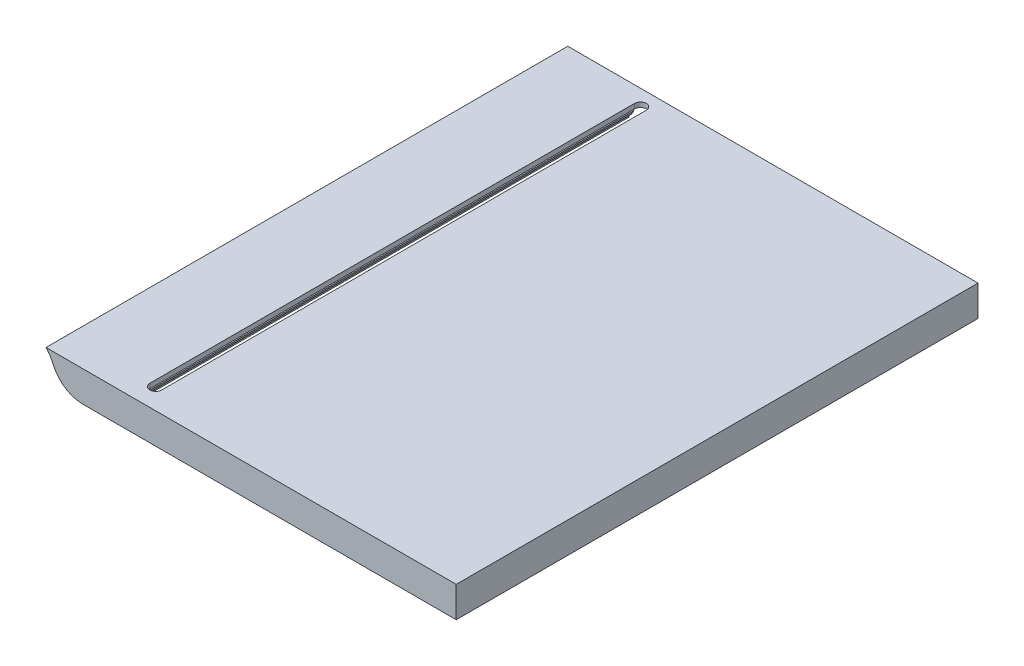
ISO-10303-21;
HEADER;
FILE_DESCRIPTION(('STEP AP214'),'2;1');
FILE_NAME('part.step','',(''),(''),'','','');
FILE_SCHEMA(('AUTOMOTIVE_DESIGN { 1 0 10303 214 1 1 1 1 }'));
ENDSEC;
DATA;
#1=APPLICATION_CONTEXT('core data for automotive mechanical design processes');
#2=APPLICATION_PROTOCOL_DEFINITION('international standard','automotive_design',2000,#1);
#3=PRODUCT_CONTEXT('',#1,'mechanical');
#4=PRODUCT('Part','Part','',(#3));
#5=PRODUCT_RELATED_PRODUCT_CATEGORY('part','',(#4));
#6=PRODUCT_DEFINITION_FORMATION('','',#4);
#7=PRODUCT_DEFINITION_CONTEXT('part definition',#1,'design');
#8=PRODUCT_DEFINITION('design','',#6,#7);
#9=PRODUCT_DEFINITION_SHAPE('','',#8);
#10=(LENGTH_UNIT() NAMED_UNIT(*) SI_UNIT(.MILLI.,.METRE.));
#11=(NAMED_UNIT(*) PLANE_ANGLE_UNIT() SI_UNIT($,.RADIAN.));
#12=(NAMED_UNIT(*) SI_UNIT($,.STERADIAN.) SOLID_ANGLE_UNIT());
#13=UNCERTAINTY_MEASURE_WITH_UNIT(LENGTH_MEASURE(1.E-05),#10,'distance_accuracy_value','');
#14=(GEOMETRIC_REPRESENTATION_CONTEXT(3) GLOBAL_UNCERTAINTY_ASSIGNED_CONTEXT((#13)) GLOBAL_UNIT_ASSIGNED_CONTEXT((#10,
#11,#12)) REPRESENTATION_CONTEXT('',''));
#15=CARTESIAN_POINT('',(0.,0.,0.));
#16=DIRECTION('',(0.,0.,1.));
#17=DIRECTION('',(1.,0.,0.));
#18=AXIS2_PLACEMENT_3D('',#15,#16,#17);
#19=CARTESIAN_POINT('',(-67.3,-102.,100.67082039325));
#20=DIRECTION('',(-0.707106781186531,0.707106781186564,0.));
#21=DIRECTION('',(-0.707106781186564,-0.707106781186531,0.));
#22=AXIS2_PLACEMENT_3D('',#19,#20,#21);
#23=PLANE('',#22);
#24=DIRECTION('',(0.,0.,-1.));
#25=VECTOR('',#24,1.);
#26=CARTESIAN_POINT('',(-67.,-101.7,100.67082039325));
#27=LINE('',#26,#25);
#28=CARTESIAN_POINT('',(-67.,-101.7,-56.8249999999984));
#29=VERTEX_POINT('',#28);
#30=CARTESIAN_POINT('',(-67.,-101.7,-59.9999999999999));
#31=VERTEX_POINT('',#30);
#32=EDGE_CURVE('E391',#29,#31,#27,.T.);
#33=ORIENTED_EDGE('',*,*,#32,.F.);
#34=CARTESIAN_POINT('',(-67.0000000000008,-101.700000000001,-55.));
#35=DIRECTION('',(-0.707106781186531,0.707106781186564,0.));
#36=DIRECTION('',(0.707106781186564,0.707106781186531,0.));
#37=AXIS2_PLACEMENT_3D('',#34,#35,#36);
#38=ELLIPSE('',#37,2.5809397513287,1.82499999999849);
#39=CARTESIAN_POINT('',(-67.3,-102.,-56.800173602738));
#40=VERTEX_POINT('',#39);
#41=EDGE_CURVE('E531',#29,#40,#38,.T.);
#42=ORIENTED_EDGE('',*,*,#41,.T.);
#43=DIRECTION('',(0.,0.,-1.));
#44=VECTOR('',#43,1.);
#45=CARTESIAN_POINT('',(-67.3,-102.,100.67082039325));
#46=LINE('',#45,#44);
#47=CARTESIAN_POINT('',(-67.3,-102.,-59.9999999999999));
#48=VERTEX_POINT('',#47);
#49=EDGE_CURVE('E400',#40,#48,#46,.T.);
#50=ORIENTED_EDGE('',*,*,#49,.T.);
#51=DIRECTION('',(0.707106781186564,0.707106781186531,0.));
#52=VECTOR('',#51,1.);
#53=CARTESIAN_POINT('',(17.3500000000015,-17.3500000000023,-60.));
#54=LINE('',#53,#52);
#55=EDGE_CURVE('E408',#48,#31,#54,.T.);
#56=ORIENTED_EDGE('',*,*,#55,.T.);
#57=EDGE_LOOP('',(#33,#42,#50,#56));
#58=FACE_BOUND('',#57,.T.);
#59=ADVANCED_FACE('F33',(#58),#23,.F.);
#60=CARTESIAN_POINT('',(-67.,-101.7,100.67082039325));
#61=DIRECTION('',(0.707106781186531,0.707106781186564,0.));
#62=DIRECTION('',(-0.707106781186564,0.707106781186531,0.));
#63=AXIS2_PLACEMENT_3D('',#60,#61,#62);
#64=PLANE('',#63);
#65=DIRECTION('',(0.,0.,-1.));
#66=VECTOR('',#65,1.);
#67=CARTESIAN_POINT('',(-66.7,-102.,100.67082039325));
#68=LINE('',#67,#66);
#69=CARTESIAN_POINT('',(-66.7,-102.,-56.8001736027377));
#70=VERTEX_POINT('',#69);
#71=CARTESIAN_POINT('',(-66.7,-102.,-60.));
#72=VERTEX_POINT('',#71);
#73=EDGE_CURVE('E395',#70,#72,#68,.T.);
#74=ORIENTED_EDGE('',*,*,#73,.F.);
#75=CARTESIAN_POINT('',(-67.0000000000008,-101.699999999999,-55.));
#76=DIRECTION('',(0.707106781186531,0.707106781186564,0.));
#77=DIRECTION('',(-0.707106781186564,0.707106781186531,0.));
#78=AXIS2_PLACEMENT_3D('',#75,#76,#77);
#79=ELLIPSE('',#78,2.58093975132872,1.82499999999849);
#80=EDGE_CURVE('E511',#70,#29,#79,.T.);
#81=ORIENTED_EDGE('',*,*,#80,.T.);
#82=ORIENTED_EDGE('',*,*,#32,.T.);
#83=DIRECTION('',(0.707106781186564,-0.707106781186531,0.));
#84=VECTOR('',#83,1.);
#85=CARTESIAN_POINT('',(-84.3499999999984,-84.3500000000023,-60.));
#86=LINE('',#85,#84);
#87=EDGE_CURVE('E405',#31,#72,#86,.T.);
#88=ORIENTED_EDGE('',*,*,#87,.T.);
#89=EDGE_LOOP('',(#74,#81,#82,#88));
#90=FACE_BOUND('',#89,.T.);
#91=ADVANCED_FACE('F627',(#90),#64,.F.);
#92=CARTESIAN_POINT('',(-91.5328115921767,-102.,80.));
#93=DIRECTION('',(0.,-1.,0.));
#94=DIRECTION('',(0.,0.,-1.));
#95=AXIS2_PLACEMENT_3D('',#92,#93,#94);
#96=PLANE('',#95);
#97=DIRECTION('',(0.,0.,-1.));
#98=VECTOR('',#97,1.);
#99=CARTESIAN_POINT('',(-76.7499999999993,-102.,80.));
#100=LINE('',#99,#98);
#101=CARTESIAN_POINT('',(-76.7499999999996,-102.,100.));
#102=VERTEX_POINT('',#101);
#103=CARTESIAN_POINT('',(-76.7499999999996,-102.,-60.));
#104=VERTEX_POINT('',#103);
#105=EDGE_CURVE('E342',#102,#104,#100,.T.);
#106=ORIENTED_EDGE('',*,*,#105,.F.);
#107=DIRECTION('',(1.,0.,0.));
#108=VECTOR('',#107,1.);
#109=CARTESIAN_POINT('',(-91.5328115921767,-102.,100.));
#110=LINE('',#109,#108);
#111=CARTESIAN_POINT('',(-91.5328115921767,-102.,100.));
#112=VERTEX_POINT('',#111);
#113=EDGE_CURVE('E456',#112,#102,#110,.T.);
#114=ORIENTED_EDGE('',*,*,#113,.F.);
#115=DIRECTION('',(0.,0.,1.));
#116=VECTOR('',#115,1.);
#117=CARTESIAN_POINT('',(-91.5328115921767,-102.,80.));
#118=LINE('',#117,#116);
#119=CARTESIAN_POINT('',(-91.5328115921768,-102.,-60.));
#120=VERTEX_POINT('',#119);
#121=EDGE_CURVE('E464',#120,#112,#118,.T.);
#122=ORIENTED_EDGE('',*,*,#121,.F.);
#123=DIRECTION('',(1.,0.,0.));
#124=VECTOR('',#123,1.);
#125=CARTESIAN_POINT('',(-91.5328115921768,-102.,-60.));
#126=LINE('',#125,#124);
#127=EDGE_CURVE('E421',#120,#104,#126,.T.);
#128=ORIENTED_EDGE('',*,*,#127,.T.);
#129=EDGE_LOOP('',(#106,#114,#122,#128));
#130=FACE_BOUND('',#129,.T.);
#131=ADVANCED_FACE('F636',(#130),#96,.T.);
#132=CARTESIAN_POINT('',(-101.758107565017,-107.555793957317,100.));
#133=DIRECTION('',(0.,0.,-1.));
#134=DIRECTION('',(-1.,0.,0.));
#135=AXIS2_PLACEMENT_3D('',#132,#133,#134);
#136=PLANE('',#135);
#137=DIRECTION('',(0.,-1.,0.));
#138=VECTOR('',#137,1.);
#139=CARTESIAN_POINT('',(-76.7499999999992,-100.5,100.));
#140=LINE('',#139,#138);
#141=CARTESIAN_POINT('',(-76.7499999999996,-108.5,100.));
#142=VERTEX_POINT('',#141);
#143=EDGE_CURVE('E304',#102,#142,#140,.T.);
#144=ORIENTED_EDGE('',*,*,#143,.T.);
#145=DIRECTION('',(-1.,0.,0.));
#146=VECTOR('',#145,1.);
#147=CARTESIAN_POINT('',(31.,-108.5,100.));
#148=LINE('',#147,#146);
#149=CARTESIAN_POINT('',(-83.,-108.5,100.));
#150=VERTEX_POINT('',#149);
#151=EDGE_CURVE('E445',#142,#150,#148,.T.);
#152=ORIENTED_EDGE('',*,*,#151,.T.);
#153=CARTESIAN_POINT('',(-83.,-99.8628386524749,100.));
#154=DIRECTION('',(0.,0.,-1.));
#155=DIRECTION('',(-1.,0.,0.));
#156=AXIS2_PLACEMENT_3D('',#153,#154,#155);
#157=CIRCLE('',#156,8.63716134752513);
#158=CARTESIAN_POINT('',(-90.9912312756488,-103.14015139957,100.));
#159=VERTEX_POINT('',#158);
#160=EDGE_CURVE('E449',#150,#159,#157,.T.);
#161=ORIENTED_EDGE('',*,*,#160,.T.);
#162=CARTESIAN_POINT('',(-101.758107565017,-107.555793957317,100.));
#163=DIRECTION('',(0.,0.,1.));
#164=DIRECTION('',(-1.,0.,0.));
#165=AXIS2_PLACEMENT_3D('',#162,#163,#164);
#166=CIRCLE('',#165,11.6371613475259);
#167=EDGE_CURVE('E452',#159,#112,#166,.T.);
#168=ORIENTED_EDGE('',*,*,#167,.T.);
#169=ORIENTED_EDGE('',*,*,#113,.T.);
#170=EDGE_LOOP('',(#144,#152,#161,#168,#169));
#171=FACE_BOUND('',#170,.T.);
#172=ADVANCED_FACE('F666',(#171),#136,.T.);
#173=DIRECTION('',(0.,1.,0.));
#174=VECTOR('',#173,1.);
#175=CARTESIAN_POINT('',(-57.25,-110.,100.));
#176=LINE('',#175,#174);
#177=CARTESIAN_POINT('',(-57.2499999999992,-108.5,100.));
#178=VERTEX_POINT('',#177);
#179=CARTESIAN_POINT('',(-57.2499999999992,-102.,100.));
#180=VERTEX_POINT('',#179);
#181=EDGE_CURVE('E306',#178,#180,#176,.T.);
#182=ORIENTED_EDGE('',*,*,#181,.T.);
#183=CARTESIAN_POINT('',(31.,-102.,100.));
#184=VERTEX_POINT('',#183);
#185=EDGE_CURVE('E455',#180,#184,#110,.T.);
#186=ORIENTED_EDGE('',*,*,#185,.T.);
#187=DIRECTION('',(0.,-1.,0.));
#188=VECTOR('',#187,1.);
#189=CARTESIAN_POINT('',(31.,-102.,100.));
#190=LINE('',#189,#188);
#191=CARTESIAN_POINT('',(31.,-108.5,100.));
#192=VERTEX_POINT('',#191);
#193=EDGE_CURVE('E442',#184,#192,#190,.T.);
#194=ORIENTED_EDGE('',*,*,#193,.T.);
#195=EDGE_CURVE('E446',#192,#178,#148,.T.);
#196=ORIENTED_EDGE('',*,*,#195,.T.);
#197=EDGE_LOOP('',(#182,#186,#194,#196));
#198=FACE_BOUND('',#197,.T.);
#199=ADVANCED_FACE('F614',(#198),#136,.T.);
#200=DIRECTION('',(0.,0.,1.));
#201=VECTOR('',#200,1.);
#202=CARTESIAN_POINT('',(-57.2499999999993,-102.,80.));
#203=LINE('',#202,#201);
#204=CARTESIAN_POINT('',(-57.2499999999992,-102.,-60.));
#205=VERTEX_POINT('',#204);
#206=EDGE_CURVE('E339',#205,#180,#203,.T.);
#207=ORIENTED_EDGE('',*,*,#206,.F.);
#208=CARTESIAN_POINT('',(31.,-102.,-60.));
#209=VERTEX_POINT('',#208);
#210=EDGE_CURVE('E420',#205,#209,#126,.T.);
#211=ORIENTED_EDGE('',*,*,#210,.T.);
#212=DIRECTION('',(0.,0.,1.));
#213=VECTOR('',#212,1.);
#214=CARTESIAN_POINT('',(31.,-102.,80.));
#215=LINE('',#214,#213);
#216=EDGE_CURVE('E459',#209,#184,#215,.T.);
#217=ORIENTED_EDGE('',*,*,#216,.T.);
#218=ORIENTED_EDGE('',*,*,#185,.F.);
#219=EDGE_LOOP('',(#207,#211,#217,#218));
#220=FACE_BOUND('',#219,.T.);
#221=ADVANCED_FACE('F599',(#220),#96,.T.);
#222=CARTESIAN_POINT('',(31.,-108.5,80.));
#223=DIRECTION('',(0.,1.,0.));
#224=DIRECTION('',(0.,0.,1.));
#225=AXIS2_PLACEMENT_3D('',#222,#223,#224);
#226=PLANE('',#225);
#227=DIRECTION('',(0.,0.,1.));
#228=VECTOR('',#227,1.);
#229=CARTESIAN_POINT('',(-76.7499999999999,-108.5,80.));
#230=LINE('',#229,#228);
#231=CARTESIAN_POINT('',(-76.7499999999996,-108.5,-60.));
#232=VERTEX_POINT('',#231);
#233=EDGE_CURVE('E345',#232,#142,#230,.T.);
#234=ORIENTED_EDGE('',*,*,#233,.F.);
#235=DIRECTION('',(-1.,0.,0.));
#236=VECTOR('',#235,1.);
#237=CARTESIAN_POINT('',(31.,-108.5,-60.));
#238=LINE('',#237,#236);
#239=CARTESIAN_POINT('',(-83.,-108.5,-60.));
#240=VERTEX_POINT('',#239);
#241=EDGE_CURVE('E414',#232,#240,#238,.T.);
#242=ORIENTED_EDGE('',*,*,#241,.T.);
#243=DIRECTION('',(0.,0.,1.));
#244=VECTOR('',#243,1.);
#245=CARTESIAN_POINT('',(-83.,-108.5,80.));
#246=LINE('',#245,#244);
#247=EDGE_CURVE('E468',#240,#150,#246,.T.);
#248=ORIENTED_EDGE('',*,*,#247,.T.);
#249=ORIENTED_EDGE('',*,*,#151,.F.);
#250=EDGE_LOOP('',(#234,#242,#248,#249));
#251=FACE_BOUND('',#250,.T.);
#252=ADVANCED_FACE('F659',(#251),#226,.T.);
#253=CARTESIAN_POINT('',(-67.0000000000008,-102.,-55.));
#254=DIRECTION('',(0.,-1.,0.));
#255=DIRECTION('',(0.,0.,-1.));
#256=AXIS2_PLACEMENT_3D('',#253,#254,#255);
#257=CIRCLE('',#256,1.82499999999849);
#258=CARTESIAN_POINT('',(-68.8249999999978,-102.,-55.));
#259=VERTEX_POINT('',#258);
#260=EDGE_CURVE('E286',#259,#40,#257,.T.);
#261=ORIENTED_EDGE('',*,*,#260,.F.);
#262=DIRECTION('',(1.32486614271938E-13,0.,-1.));
#263=VECTOR('',#262,1.);
#264=CARTESIAN_POINT('',(-68.8250000000157,-102.,80.000000000003));
#265=LINE('',#264,#263);
#266=CARTESIAN_POINT('',(-68.8250000000008,-102.,94.9999999999967));
#267=VERTEX_POINT('',#266);
#268=EDGE_CURVE('E279',#267,#259,#265,.T.);
#269=ORIENTED_EDGE('',*,*,#268,.F.);
#270=CARTESIAN_POINT('',(-67.0000000000008,-102.,95.));
#271=DIRECTION('',(0.,-1.,0.));
#272=DIRECTION('',(0.,0.,-1.));
#273=AXIS2_PLACEMENT_3D('',#270,#271,#272);
#274=CIRCLE('',#273,1.82499999999999);
#275=CARTESIAN_POINT('',(-67.3,-102.,96.8001736027396));
#276=VERTEX_POINT('',#275);
#277=EDGE_CURVE('E265',#276,#267,#274,.T.);
#278=ORIENTED_EDGE('',*,*,#277,.F.);
#279=CARTESIAN_POINT('',(-67.3,-102.,100.));
#280=VERTEX_POINT('',#279);
#281=EDGE_CURVE('E403',#280,#276,#46,.T.);
#282=ORIENTED_EDGE('',*,*,#281,.F.);
#283=CARTESIAN_POINT('',(-75.4999999999992,-102.,100.));
#284=VERTEX_POINT('',#283);
#285=EDGE_CURVE('E460',#284,#280,#110,.T.);
#286=ORIENTED_EDGE('',*,*,#285,.F.);
#287=DIRECTION('',(0.,0.,-1.));
#288=VECTOR('',#287,1.);
#289=CARTESIAN_POINT('',(-75.4999999999992,-102.,121.691011963485));
#290=LINE('',#289,#288);
#291=CARTESIAN_POINT('',(-75.4999999999992,-102.,-60.));
#292=VERTEX_POINT('',#291);
#293=EDGE_CURVE('E328',#284,#292,#290,.T.);
#294=ORIENTED_EDGE('',*,*,#293,.T.);
#295=EDGE_CURVE('E424',#292,#48,#126,.T.);
#296=ORIENTED_EDGE('',*,*,#295,.T.);
#297=ORIENTED_EDGE('',*,*,#49,.F.);
#298=EDGE_LOOP('',(#261,#269,#278,#282,#286,#294,#296,#297));
#299=FACE_BOUND('',#298,.T.);
#300=ADVANCED_FACE('F284',(#299),#96,.T.);
#301=CARTESIAN_POINT('',(-101.758107565017,-107.555793957317,101.5));
#302=DIRECTION('',(0.,0.,-1.));
#303=DIRECTION('',(-1.,0.,0.));
#304=AXIS2_PLACEMENT_3D('',#301,#302,#303);
#305=CYLINDRICAL_SURFACE('',#304,10.1371613475259);
#306=DIRECTION('',(0.,0.,-1.));
#307=VECTOR('',#306,1.);
#308=CARTESIAN_POINT('',(-94.479521725882,-100.5,101.5));
#309=LINE('',#308,#307);
#310=CARTESIAN_POINT('',(-94.479521725882,-100.5,101.5));
#311=VERTEX_POINT('',#310);
#312=CARTESIAN_POINT('',(-94.479521725882,-100.5,-60.));
#313=VERTEX_POINT('',#312);
#314=EDGE_CURVE('E486',#311,#313,#309,.T.);
#315=ORIENTED_EDGE('',*,*,#314,.T.);
#316=CARTESIAN_POINT('',(-101.758107565017,-107.555793957317,-60.));
#317=DIRECTION('',(0.,0.,-1.));
#318=DIRECTION('',(-1.,0.,0.));
#319=AXIS2_PLACEMENT_3D('',#316,#317,#318);
#320=CIRCLE('',#319,10.1371613475259);
#321=CARTESIAN_POINT('',(-92.3790537825084,-103.709316304896,-60.));
#322=VERTEX_POINT('',#321);
#323=EDGE_CURVE('E436',#322,#313,#320,.F.);
#324=ORIENTED_EDGE('',*,*,#323,.F.);
#325=DIRECTION('',(0.,0.,-1.));
#326=VECTOR('',#325,1.);
#327=CARTESIAN_POINT('',(-92.3790537825084,-103.709316304896,101.5));
#328=LINE('',#327,#326);
#329=CARTESIAN_POINT('',(-92.3790537825084,-103.709316304896,101.5));
#330=VERTEX_POINT('',#329);
#331=EDGE_CURVE('E485',#330,#322,#328,.T.);
#332=ORIENTED_EDGE('',*,*,#331,.F.);
#333=CARTESIAN_POINT('',(-101.758107565017,-107.555793957317,101.5));
#334=DIRECTION('',(0.,0.,-1.));
#335=DIRECTION('',(-1.,0.,0.));
#336=AXIS2_PLACEMENT_3D('',#333,#334,#335);
#337=CIRCLE('',#336,10.1371613475259);
#338=EDGE_CURVE('E474',#311,#330,#337,.T.);
#339=ORIENTED_EDGE('',*,*,#338,.F.);
#340=EDGE_LOOP('',(#315,#324,#332,#339));
#341=FACE_BOUND('',#340,.T.);
#342=ADVANCED_FACE('F35',(#341),#305,.F.);
#343=CARTESIAN_POINT('',(-94.479521725882,-100.5,101.5));
#344=DIRECTION('',(0.,1.,0.));
#345=DIRECTION('',(1.,0.,0.));
#346=AXIS2_PLACEMENT_3D('',#343,#344,#345);
#347=PLANE('',#346);
#348=CARTESIAN_POINT('',(-67.0000000000008,-100.5,-55.));
#349=DIRECTION('',(0.,1.,0.));
#350=DIRECTION('',(-1.,0.,0.));
#351=AXIS2_PLACEMENT_3D('',#348,#349,#350);
#352=CIRCLE('',#351,1.82499999999849);
#353=CARTESIAN_POINT('',(-65.1750000000008,-100.5,-55.));
#354=VERTEX_POINT('',#353);
#355=CARTESIAN_POINT('',(-68.8249999999978,-100.5,-55.));
#356=VERTEX_POINT('',#355);
#357=EDGE_CURVE('E293',#354,#356,#352,.T.);
#358=ORIENTED_EDGE('',*,*,#357,.F.);
#359=DIRECTION('',(1.12502599828685E-13,0.,-1.));
#360=VECTOR('',#359,1.);
#361=CARTESIAN_POINT('',(-65.1750000000184,-100.5,101.500000000003));
#362=LINE('',#361,#360);
#363=CARTESIAN_POINT('',(-65.1750000000177,-100.5,94.9999999999969));
#364=VERTEX_POINT('',#363);
#365=EDGE_CURVE('E288',#364,#354,#362,.T.);
#366=ORIENTED_EDGE('',*,*,#365,.F.);
#367=CARTESIAN_POINT('',(-67.0000000000008,-100.5,95.));
#368=DIRECTION('',(0.,1.,0.));
#369=DIRECTION('',(-1.,0.,0.));
#370=AXIS2_PLACEMENT_3D('',#367,#368,#369);
#371=CIRCLE('',#370,1.82499999999999);
#372=CARTESIAN_POINT('',(-68.8250000000008,-100.5,94.9999999999967));
#373=VERTEX_POINT('',#372);
#374=EDGE_CURVE('E276',#373,#364,#371,.T.);
#375=ORIENTED_EDGE('',*,*,#374,.F.);
#376=DIRECTION('',(-1.32486614271938E-13,0.,1.));
#377=VECTOR('',#376,1.);
#378=CARTESIAN_POINT('',(-68.8250000000185,-100.5,101.500000000003));
#379=LINE('',#378,#377);
#380=EDGE_CURVE('E11',#356,#373,#379,.T.);
#381=ORIENTED_EDGE('',*,*,#380,.F.);
#382=EDGE_LOOP('',(#358,#366,#375,#381));
#383=FACE_BOUND('',#382,.T.);
#384=DIRECTION('',(0.,0.,-1.));
#385=VECTOR('',#384,1.);
#386=CARTESIAN_POINT('',(32.5,-100.5,101.5));
#387=LINE('',#386,#385);
#388=CARTESIAN_POINT('',(32.5,-100.5,101.5));
#389=VERTEX_POINT('',#388);
#390=CARTESIAN_POINT('',(32.5,-100.5,-60.));
#391=VERTEX_POINT('',#390);
#392=EDGE_CURVE('E489',#389,#391,#387,.T.);
#393=ORIENTED_EDGE('',*,*,#392,.T.);
#394=DIRECTION('',(1.,0.,0.));
#395=VECTOR('',#394,1.);
#396=CARTESIAN_POINT('',(-94.479521725882,-100.5,-60.));
#397=LINE('',#396,#395);
#398=EDGE_CURVE('E434',#313,#391,#397,.T.);
#399=ORIENTED_EDGE('',*,*,#398,.F.);
#400=ORIENTED_EDGE('',*,*,#314,.F.);
#401=DIRECTION('',(-1.,0.,0.));
#402=VECTOR('',#401,1.);
#403=CARTESIAN_POINT('',(-94.479521725882,-100.5,101.5));
#404=LINE('',#403,#402);
#405=EDGE_CURVE('E483',#389,#311,#404,.T.);
#406=ORIENTED_EDGE('',*,*,#405,.F.);
#407=EDGE_LOOP('',(#393,#399,#400,#406));
#408=FACE_BOUND('',#407,.T.);
#409=ADVANCED_FACE('F540',(#383,#408),#347,.T.);
#410=CARTESIAN_POINT('',(32.5,-100.5,101.5));
#411=DIRECTION('',(1.,0.,0.));
#412=DIRECTION('',(0.,0.,-1.));
#413=AXIS2_PLACEMENT_3D('',#410,#411,#412);
#414=PLANE('',#413);
#415=DIRECTION('',(0.,0.,-1.));
#416=VECTOR('',#415,1.);
#417=CARTESIAN_POINT('',(32.5,-110.,101.5));
#418=LINE('',#417,#416);
#419=CARTESIAN_POINT('',(32.5,-110.,101.5));
#420=VERTEX_POINT('',#419);
#421=CARTESIAN_POINT('',(32.5,-110.,-60.));
#422=VERTEX_POINT('',#421);
#423=EDGE_CURVE('E492',#420,#422,#418,.T.);
#424=ORIENTED_EDGE('',*,*,#423,.T.);
#425=DIRECTION('',(0.,-1.,0.));
#426=VECTOR('',#425,1.);
#427=CARTESIAN_POINT('',(32.5,-100.5,-60.));
#428=LINE('',#427,#426);
#429=EDGE_CURVE('E431',#391,#422,#428,.T.);
#430=ORIENTED_EDGE('',*,*,#429,.F.);
#431=ORIENTED_EDGE('',*,*,#392,.F.);
#432=DIRECTION('',(0.,1.,0.));
#433=VECTOR('',#432,1.);
#434=CARTESIAN_POINT('',(32.5,-100.5,101.5));
#435=LINE('',#434,#433);
#436=EDGE_CURVE('E481',#420,#389,#435,.T.);
#437=ORIENTED_EDGE('',*,*,#436,.F.);
#438=EDGE_LOOP('',(#424,#430,#431,#437));
#439=FACE_BOUND('',#438,.T.);
#440=ADVANCED_FACE('F543',(#439),#414,.T.);
#441=CARTESIAN_POINT('',(-83.,-110.,101.5));
#442=DIRECTION('',(0.,-1.,0.));
#443=DIRECTION('',(0.,0.,1.));
#444=AXIS2_PLACEMENT_3D('',#441,#442,#443);
#445=PLANE('',#444);
#446=DIRECTION('',(0.,0.,-1.));
#447=VECTOR('',#446,1.);
#448=CARTESIAN_POINT('',(-83.,-110.,101.5));
#449=LINE('',#448,#447);
#450=CARTESIAN_POINT('',(-83.,-110.,101.5));
#451=VERTEX_POINT('',#450);
#452=CARTESIAN_POINT('',(-83.,-110.,-60.));
#453=VERTEX_POINT('',#452);
#454=EDGE_CURVE('E494',#451,#453,#449,.T.);
#455=ORIENTED_EDGE('',*,*,#454,.T.);
#456=DIRECTION('',(-1.,0.,0.));
#457=VECTOR('',#456,1.);
#458=CARTESIAN_POINT('',(32.5,-110.,-60.));
#459=LINE('',#458,#457);
#460=CARTESIAN_POINT('',(-75.5,-110.,-60.));
#461=VERTEX_POINT('',#460);
#462=EDGE_CURVE('E428',#461,#453,#459,.T.);
#463=ORIENTED_EDGE('',*,*,#462,.F.);
#464=DIRECTION('',(0.,0.,-1.));
#465=VECTOR('',#464,1.);
#466=CARTESIAN_POINT('',(-75.5,-110.,117.298554852935));
#467=LINE('',#466,#465);
#468=CARTESIAN_POINT('',(-75.5,-110.,100.));
#469=VERTEX_POINT('',#468);
#470=EDGE_CURVE('E369',#469,#461,#467,.T.);
#471=ORIENTED_EDGE('',*,*,#470,.F.);
#472=DIRECTION('',(-1.,0.,0.));
#473=VECTOR('',#472,1.);
#474=CARTESIAN_POINT('',(-58.5,-110.,100.));
#475=LINE('',#474,#473);
#476=CARTESIAN_POINT('',(-58.5,-110.,100.));
#477=VERTEX_POINT('',#476);
#478=EDGE_CURVE('E370',#477,#469,#475,.T.);
#479=ORIENTED_EDGE('',*,*,#478,.F.);
#480=DIRECTION('',(0.,0.,-1.));
#481=VECTOR('',#480,1.);
#482=CARTESIAN_POINT('',(-58.5,-110.,117.298554852935));
#483=LINE('',#482,#481);
#484=CARTESIAN_POINT('',(-58.5,-110.,-60.));
#485=VERTEX_POINT('',#484);
#486=EDGE_CURVE('E351',#477,#485,#483,.T.);
#487=ORIENTED_EDGE('',*,*,#486,.T.);
#488=EDGE_CURVE('E429',#422,#485,#459,.T.);
#489=ORIENTED_EDGE('',*,*,#488,.F.);
#490=ORIENTED_EDGE('',*,*,#423,.F.);
#491=DIRECTION('',(1.,0.,0.));
#492=VECTOR('',#491,1.);
#493=CARTESIAN_POINT('',(-83.,-110.,101.5));
#494=LINE('',#493,#492);
#495=EDGE_CURVE('E479',#451,#420,#494,.T.);
#496=ORIENTED_EDGE('',*,*,#495,.F.);
#497=EDGE_LOOP('',(#455,#463,#471,#479,#487,#489,#490,#496));
#498=FACE_BOUND('',#497,.T.);
#499=ADVANCED_FACE('F567',(#498),#445,.T.);
#500=CARTESIAN_POINT('',(-83.,-99.8628386524749,101.5));
#501=DIRECTION('',(0.,0.,-1.));
#502=DIRECTION('',(-1.,0.,0.));
#503=AXIS2_PLACEMENT_3D('',#500,#501,#502);
#504=CYLINDRICAL_SURFACE('',#503,10.1371613475251);
#505=ORIENTED_EDGE('',*,*,#331,.T.);
#506=CARTESIAN_POINT('',(-83.,-99.8628386524749,-60.));
#507=DIRECTION('',(0.,0.,-1.));
#508=DIRECTION('',(-1.,0.,0.));
#509=AXIS2_PLACEMENT_3D('',#506,#507,#508);
#510=CIRCLE('',#509,10.1371613475251);
#511=EDGE_CURVE('E423',#453,#322,#510,.T.);
#512=ORIENTED_EDGE('',*,*,#511,.F.);
#513=ORIENTED_EDGE('',*,*,#454,.F.);
#514=CARTESIAN_POINT('',(-83.,-99.8628386524749,101.5));
#515=DIRECTION('',(0.,0.,1.));
#516=DIRECTION('',(-1.,0.,0.));
#517=AXIS2_PLACEMENT_3D('',#514,#515,#516);
#518=CIRCLE('',#517,10.1371613475251);
#519=EDGE_CURVE('E477',#330,#451,#518,.T.);
#520=ORIENTED_EDGE('',*,*,#519,.F.);
#521=EDGE_LOOP('',(#505,#512,#513,#520));
#522=FACE_BOUND('',#521,.T.);
#523=ADVANCED_FACE('F664',(#522),#504,.T.);
#524=CARTESIAN_POINT('',(-101.758107565017,-107.555793957317,101.5));
#525=DIRECTION('',(0.,0.,-1.));
#526=DIRECTION('',(-1.,0.,0.));
#527=AXIS2_PLACEMENT_3D('',#524,#525,#526);
#528=PLANE('',#527);
#529=ORIENTED_EDGE('',*,*,#338,.T.);
#530=ORIENTED_EDGE('',*,*,#519,.T.);
#531=ORIENTED_EDGE('',*,*,#495,.T.);
#532=ORIENTED_EDGE('',*,*,#436,.T.);
#533=ORIENTED_EDGE('',*,*,#405,.T.);
#534=EDGE_LOOP('',(#529,#530,#531,#532,#533));
#535=FACE_BOUND('',#534,.T.);
#536=ADVANCED_FACE('F563',(#535),#528,.F.);
#537=CARTESIAN_POINT('',(0.,0.,-60.));
#538=DIRECTION('',(0.,0.,-1.));
#539=DIRECTION('',(-1.,0.,0.));
#540=AXIS2_PLACEMENT_3D('',#537,#538,#539);
#541=PLANE('',#540);
#542=ORIENTED_EDGE('',*,*,#241,.F.);
#543=DIRECTION('',(0.,1.,0.));
#544=VECTOR('',#543,1.);
#545=CARTESIAN_POINT('',(-76.7499999999992,-100.5,-60.));
#546=LINE('',#545,#544);
#547=EDGE_CURVE('E317',#232,#104,#546,.T.);
#548=ORIENTED_EDGE('',*,*,#547,.T.);
#549=ORIENTED_EDGE('',*,*,#127,.F.);
#550=CARTESIAN_POINT('',(-101.758107565017,-107.555793957317,-60.));
#551=DIRECTION('',(0.,0.,-1.));
#552=DIRECTION('',(-1.,0.,0.));
#553=AXIS2_PLACEMENT_3D('',#550,#551,#552);
#554=CIRCLE('',#553,11.6371613475259);
#555=CARTESIAN_POINT('',(-90.9912312756488,-103.14015139957,-60.));
#556=VERTEX_POINT('',#555);
#557=EDGE_CURVE('E439',#556,#120,#554,.F.);
#558=ORIENTED_EDGE('',*,*,#557,.F.);
#559=CARTESIAN_POINT('',(-83.,-99.8628386524749,-60.));
#560=DIRECTION('',(0.,0.,-1.));
#561=DIRECTION('',(-1.,0.,0.));
#562=AXIS2_PLACEMENT_3D('',#559,#560,#561);
#563=CIRCLE('',#562,8.63716134752514);
#564=EDGE_CURVE('E411',#240,#556,#563,.T.);
#565=ORIENTED_EDGE('',*,*,#564,.F.);
#566=EDGE_LOOP('',(#542,#548,#549,#558,#565));
#567=FACE_BOUND('',#566,.T.);
#568=ORIENTED_EDGE('',*,*,#210,.F.);
#569=DIRECTION('',(0.,-1.,0.));
#570=VECTOR('',#569,1.);
#571=CARTESIAN_POINT('',(-57.25,-110.,-60.));
#572=LINE('',#571,#570);
#573=CARTESIAN_POINT('',(-57.2499999999992,-108.5,-60.));
#574=VERTEX_POINT('',#573);
#575=EDGE_CURVE('E320',#205,#574,#572,.T.);
#576=ORIENTED_EDGE('',*,*,#575,.T.);
#577=CARTESIAN_POINT('',(31.,-108.5,-60.));
#578=VERTEX_POINT('',#577);
#579=EDGE_CURVE('E415',#578,#574,#238,.T.);
#580=ORIENTED_EDGE('',*,*,#579,.F.);
#581=DIRECTION('',(0.,-1.,0.));
#582=VECTOR('',#581,1.);
#583=CARTESIAN_POINT('',(31.,-102.,-60.));
#584=LINE('',#583,#582);
#585=EDGE_CURVE('E417',#209,#578,#584,.T.);
#586=ORIENTED_EDGE('',*,*,#585,.F.);
#587=EDGE_LOOP('',(#568,#576,#580,#586));
#588=FACE_BOUND('',#587,.T.);
#589=DIRECTION('',(1.,0.,0.));
#590=VECTOR('',#589,1.);
#591=CARTESIAN_POINT('',(-73.9999999999991,-107.55,-60.));
#592=LINE('',#591,#590);
#593=CARTESIAN_POINT('',(-75.4999999999991,-107.55,-60.));
#594=VERTEX_POINT('',#593);
#595=CARTESIAN_POINT('',(-73.9999999999991,-107.55,-60.));
#596=VERTEX_POINT('',#595);
#597=EDGE_CURVE('E314',#594,#596,#592,.T.);
#598=ORIENTED_EDGE('',*,*,#597,.T.);
#599=DIRECTION('',(0.500000000000002,0.866025403784437,0.));
#600=VECTOR('',#599,1.);
#601=CARTESIAN_POINT('',(-8.9294839114915,5.15543994002408,-60.));
#602=LINE('',#601,#600);
#603=CARTESIAN_POINT('',(-74.721687836487,-108.8,-60.));
#604=VERTEX_POINT('',#603);
#605=EDGE_CURVE('E386',#604,#596,#602,.T.);
#606=ORIENTED_EDGE('',*,*,#605,.F.);
#607=DIRECTION('',(1.,0.,0.));
#608=VECTOR('',#607,1.);
#609=CARTESIAN_POINT('',(-3.8799427383357E-12,-108.800000000003,-60.));
#610=LINE('',#609,#608);
#611=CARTESIAN_POINT('',(-75.5,-108.8,-60.));
#612=VERTEX_POINT('',#611);
#613=EDGE_CURVE('E502',#612,#604,#610,.T.);
#614=ORIENTED_EDGE('',*,*,#613,.F.);
#615=DIRECTION('',(0.,1.,0.));
#616=VECTOR('',#615,1.);
#617=CARTESIAN_POINT('',(-75.5,0.,-60.));
#618=LINE('',#617,#616);
#619=EDGE_CURVE('E504',#461,#612,#618,.T.);
#620=ORIENTED_EDGE('',*,*,#619,.F.);
#621=ORIENTED_EDGE('',*,*,#462,.T.);
#622=ORIENTED_EDGE('',*,*,#511,.T.);
#623=ORIENTED_EDGE('',*,*,#323,.T.);
#624=ORIENTED_EDGE('',*,*,#398,.T.);
#625=ORIENTED_EDGE('',*,*,#429,.T.);
#626=ORIENTED_EDGE('',*,*,#488,.T.);
#627=DIRECTION('',(0.,-1.,0.));
#628=VECTOR('',#627,1.);
#629=CARTESIAN_POINT('',(-58.5,0.,-60.));
#630=LINE('',#629,#628);
#631=CARTESIAN_POINT('',(-58.5,-108.8,-60.));
#632=VERTEX_POINT('',#631);
#633=EDGE_CURVE('E499',#632,#485,#630,.T.);
#634=ORIENTED_EDGE('',*,*,#633,.F.);
#635=DIRECTION('',(1.,0.,0.));
#636=VECTOR('',#635,1.);
#637=CARTESIAN_POINT('',(0.,-108.8,-60.));
#638=LINE('',#637,#636);
#639=CARTESIAN_POINT('',(-59.278312163513,-108.8,-60.));
#640=VERTEX_POINT('',#639);
#641=EDGE_CURVE('E488',#640,#632,#638,.T.);
#642=ORIENTED_EDGE('',*,*,#641,.F.);
#643=DIRECTION('',(0.500000000000001,-0.866025403784438,0.));
#644=VECTOR('',#643,1.);
#645=CARTESIAN_POINT('',(-91.5705160885082,-52.8682621135333,-60.));
#646=LINE('',#645,#644);
#647=CARTESIAN_POINT('',(-59.9999999999991,-107.55,-60.));
#648=VERTEX_POINT('',#647);
#649=EDGE_CURVE('E384',#648,#640,#646,.T.);
#650=ORIENTED_EDGE('',*,*,#649,.F.);
#651=DIRECTION('',(1.,0.,0.));
#652=VECTOR('',#651,1.);
#653=CARTESIAN_POINT('',(-58.4999999999991,-107.55,-60.));
#654=LINE('',#653,#652);
#655=CARTESIAN_POINT('',(-58.4999999999991,-107.55,-60.));
#656=VERTEX_POINT('',#655);
#657=EDGE_CURVE('E287',#648,#656,#654,.T.);
#658=ORIENTED_EDGE('',*,*,#657,.T.);
#659=DIRECTION('',(0.,1.,0.));
#660=VECTOR('',#659,1.);
#661=CARTESIAN_POINT('',(-58.4999999999992,-102.,-60.));
#662=LINE('',#661,#660);
#663=CARTESIAN_POINT('',(-58.4999999999991,-102.,-60.));
#664=VERTEX_POINT('',#663);
#665=EDGE_CURVE('E291',#656,#664,#662,.T.);
#666=ORIENTED_EDGE('',*,*,#665,.T.);
#667=EDGE_CURVE('E425',#72,#664,#126,.T.);
#668=ORIENTED_EDGE('',*,*,#667,.F.);
#669=ORIENTED_EDGE('',*,*,#87,.F.);
#670=ORIENTED_EDGE('',*,*,#55,.F.);
#671=ORIENTED_EDGE('',*,*,#295,.F.);
#672=DIRECTION('',(0.,-1.,0.));
#673=VECTOR('',#672,1.);
#674=CARTESIAN_POINT('',(-75.4999999999991,-107.55,-60.));
#675=LINE('',#674,#673);
#676=EDGE_CURVE('E311',#292,#594,#675,.T.);
#677=ORIENTED_EDGE('',*,*,#676,.T.);
#678=EDGE_LOOP('',(#598,#606,#614,#620,#621,#622,#623,#624,#625,#626,#634,#642,#650,#658,#666,
#668,#669,#670,#671,#677));
#679=FACE_BOUND('',#678,.T.);
#680=ADVANCED_FACE('F555',(#567,#588,#679),#541,.T.);
#681=DIRECTION('',(0.500000000000002,0.866025403784437,0.));
#682=VECTOR('',#681,1.);
#683=CARTESIAN_POINT('',(-73.5669872981083,-106.800000000001,100.));
#684=LINE('',#683,#682);
#685=CARTESIAN_POINT('',(-74.721687836487,-108.8,100.));
#686=VERTEX_POINT('',#685);
#687=CARTESIAN_POINT('',(-73.9999999999991,-107.55,100.));
#688=VERTEX_POINT('',#687);
#689=EDGE_CURVE('E359',#686,#688,#684,.T.);
#690=ORIENTED_EDGE('',*,*,#689,.T.);
#691=DIRECTION('',(-1.,0.,0.));
#692=VECTOR('',#691,1.);
#693=CARTESIAN_POINT('',(-73.9999999999991,-107.55,100.));
#694=LINE('',#693,#692);
#695=CARTESIAN_POINT('',(-75.4999999999991,-107.55,100.));
#696=VERTEX_POINT('',#695);
#697=EDGE_CURVE('E302',#688,#696,#694,.T.);
#698=ORIENTED_EDGE('',*,*,#697,.T.);
#699=DIRECTION('',(0.,1.,0.));
#700=VECTOR('',#699,1.);
#701=CARTESIAN_POINT('',(-75.4999999999991,-107.55,100.));
#702=LINE('',#701,#700);
#703=EDGE_CURVE('E299',#696,#284,#702,.T.);
#704=ORIENTED_EDGE('',*,*,#703,.T.);
#705=ORIENTED_EDGE('',*,*,#285,.T.);
#706=DIRECTION('',(0.707106781186564,0.707106781186531,0.));
#707=VECTOR('',#706,1.);
#708=CARTESIAN_POINT('',(-67.3,-102.,100.));
#709=LINE('',#708,#707);
#710=CARTESIAN_POINT('',(-67.,-101.7,100.));
#711=VERTEX_POINT('',#710);
#712=EDGE_CURVE('E388',#280,#711,#709,.T.);
#713=ORIENTED_EDGE('',*,*,#712,.T.);
#714=DIRECTION('',(0.707106781186564,-0.707106781186531,0.));
#715=VECTOR('',#714,1.);
#716=CARTESIAN_POINT('',(-67.,-101.7,100.));
#717=LINE('',#716,#715);
#718=CARTESIAN_POINT('',(-66.7,-102.,100.));
#719=VERTEX_POINT('',#718);
#720=EDGE_CURVE('E392',#711,#719,#717,.T.);
#721=ORIENTED_EDGE('',*,*,#720,.T.);
#722=CARTESIAN_POINT('',(-58.4999999999991,-102.,100.));
#723=VERTEX_POINT('',#722);
#724=EDGE_CURVE('E461',#719,#723,#110,.T.);
#725=ORIENTED_EDGE('',*,*,#724,.T.);
#726=DIRECTION('',(0.,-1.,0.));
#727=VECTOR('',#726,1.);
#728=CARTESIAN_POINT('',(-58.4999999999992,-102.,100.));
#729=LINE('',#728,#727);
#730=CARTESIAN_POINT('',(-58.4999999999991,-107.55,100.));
#731=VERTEX_POINT('',#730);
#732=EDGE_CURVE('E297',#723,#731,#729,.T.);
#733=ORIENTED_EDGE('',*,*,#732,.T.);
#734=DIRECTION('',(-1.,0.,0.));
#735=VECTOR('',#734,1.);
#736=CARTESIAN_POINT('',(-58.4999999999991,-107.55,100.));
#737=LINE('',#736,#735);
#738=CARTESIAN_POINT('',(-59.9999999999991,-107.55,100.));
#739=VERTEX_POINT('',#738);
#740=EDGE_CURVE('E307',#731,#739,#737,.T.);
#741=ORIENTED_EDGE('',*,*,#740,.T.);
#742=DIRECTION('',(0.500000000000001,-0.866025403784438,0.));
#743=VECTOR('',#742,1.);
#744=CARTESIAN_POINT('',(-59.278312163513,-108.8,100.));
#745=LINE('',#744,#743);
#746=CARTESIAN_POINT('',(-59.278312163513,-108.8,100.));
#747=VERTEX_POINT('',#746);
#748=EDGE_CURVE('E357',#739,#747,#745,.T.);
#749=ORIENTED_EDGE('',*,*,#748,.T.);
#750=DIRECTION('',(1.,0.,0.));
#751=VECTOR('',#750,1.);
#752=CARTESIAN_POINT('',(-58.5,-108.8,100.));
#753=LINE('',#752,#751);
#754=CARTESIAN_POINT('',(-58.5,-108.8,100.));
#755=VERTEX_POINT('',#754);
#756=EDGE_CURVE('E352',#747,#755,#753,.T.);
#757=ORIENTED_EDGE('',*,*,#756,.T.);
#758=DIRECTION('',(0.,-1.,0.));
#759=VECTOR('',#758,1.);
#760=CARTESIAN_POINT('',(-58.5,-108.8,100.));
#761=LINE('',#760,#759);
#762=EDGE_CURVE('E348',#755,#477,#761,.T.);
#763=ORIENTED_EDGE('',*,*,#762,.T.);
#764=ORIENTED_EDGE('',*,*,#478,.T.);
#765=DIRECTION('',(0.,1.,0.));
#766=VECTOR('',#765,1.);
#767=CARTESIAN_POINT('',(-75.5,-108.8,100.));
#768=LINE('',#767,#766);
#769=CARTESIAN_POINT('',(-75.5,-108.8,100.));
#770=VERTEX_POINT('',#769);
#771=EDGE_CURVE('E366',#469,#770,#768,.T.);
#772=ORIENTED_EDGE('',*,*,#771,.T.);
#773=DIRECTION('',(1.,0.,0.));
#774=VECTOR('',#773,1.);
#775=CARTESIAN_POINT('',(-74.721687836487,-108.8,100.));
#776=LINE('',#775,#774);
#777=EDGE_CURVE('E362',#770,#686,#776,.T.);
#778=ORIENTED_EDGE('',*,*,#777,.T.);
#779=EDGE_LOOP('',(#690,#698,#704,#705,#713,#721,#725,#733,#741,#749,#757,#763,#764,#772,#778));
#780=FACE_BOUND('',#779,.T.);
#781=ADVANCED_FACE('F573',(#780),#136,.T.);
#782=CARTESIAN_POINT('',(-83.,-99.8628386524749,80.));
#783=DIRECTION('',(0.,0.,1.));
#784=DIRECTION('',(1.,0.,0.));
#785=AXIS2_PLACEMENT_3D('',#782,#783,#784);
#786=CYLINDRICAL_SURFACE('',#785,8.63716134752513);
#787=ORIENTED_EDGE('',*,*,#160,.F.);
#788=ORIENTED_EDGE('',*,*,#247,.F.);
#789=ORIENTED_EDGE('',*,*,#564,.T.);
#790=DIRECTION('',(0.,0.,1.));
#791=VECTOR('',#790,1.);
#792=CARTESIAN_POINT('',(-90.9912312756488,-103.14015139957,80.));
#793=LINE('',#792,#791);
#794=EDGE_CURVE('E466',#556,#159,#793,.T.);
#795=ORIENTED_EDGE('',*,*,#794,.T.);
#796=EDGE_LOOP('',(#787,#788,#789,#795));
#797=FACE_BOUND('',#796,.T.);
#798=ADVANCED_FACE('F652',(#797),#786,.F.);
#799=CARTESIAN_POINT('',(-101.758107565017,-107.555793957317,80.));
#800=DIRECTION('',(0.,0.,1.));
#801=DIRECTION('',(1.,0.,0.));
#802=AXIS2_PLACEMENT_3D('',#799,#800,#801);
#803=CYLINDRICAL_SURFACE('',#802,11.6371613475259);
#804=ORIENTED_EDGE('',*,*,#167,.F.);
#805=ORIENTED_EDGE('',*,*,#794,.F.);
#806=ORIENTED_EDGE('',*,*,#557,.T.);
#807=ORIENTED_EDGE('',*,*,#121,.T.);
#808=EDGE_LOOP('',(#804,#805,#806,#807));
#809=FACE_BOUND('',#808,.T.);
#810=ADVANCED_FACE('F649',(#809),#803,.T.);
#811=CARTESIAN_POINT('',(-67.0000000000008,-102.,-55.));
#812=DIRECTION('',(0.,-1.,0.));
#813=DIRECTION('',(0.,0.,-1.));
#814=AXIS2_PLACEMENT_3D('',#811,#812,#813);
#815=CIRCLE('',#814,1.82499999999849);
#816=CARTESIAN_POINT('',(-65.1750000000008,-102.,-55.));
#817=VERTEX_POINT('',#816);
#818=EDGE_CURVE('E534',#70,#817,#815,.T.);
#819=ORIENTED_EDGE('',*,*,#818,.F.);
#820=ORIENTED_EDGE('',*,*,#73,.T.);
#821=ORIENTED_EDGE('',*,*,#667,.T.);
#822=DIRECTION('',(0.,0.,-1.));
#823=VECTOR('',#822,1.);
#824=CARTESIAN_POINT('',(-58.4999999999992,-102.,121.691011963485));
#825=LINE('',#824,#823);
#826=EDGE_CURVE('E330',#723,#664,#825,.T.);
#827=ORIENTED_EDGE('',*,*,#826,.F.);
#828=ORIENTED_EDGE('',*,*,#724,.F.);
#829=CARTESIAN_POINT('',(-66.7,-102.,96.8001736027393));
#830=VERTEX_POINT('',#829);
#831=EDGE_CURVE('E397',#719,#830,#68,.T.);
#832=ORIENTED_EDGE('',*,*,#831,.T.);
#833=CARTESIAN_POINT('',(-67.0000000000008,-102.,95.));
#834=DIRECTION('',(0.,-1.,0.));
#835=DIRECTION('',(0.,0.,-1.));
#836=AXIS2_PLACEMENT_3D('',#833,#834,#835);
#837=CIRCLE('',#836,1.82499999999999);
#838=CARTESIAN_POINT('',(-65.1750000000177,-102.,94.9999999999969));
#839=VERTEX_POINT('',#838);
#840=EDGE_CURVE('E55',#839,#830,#837,.T.);
#841=ORIENTED_EDGE('',*,*,#840,.F.);
#842=DIRECTION('',(-1.12502599828685E-13,0.,1.));
#843=VECTOR('',#842,1.);
#844=CARTESIAN_POINT('',(-65.175000000016,-102.,80.000000000003));
#845=LINE('',#844,#843);
#846=EDGE_CURVE('E41',#817,#839,#845,.T.);
#847=ORIENTED_EDGE('',*,*,#846,.F.);
#848=EDGE_LOOP('',(#819,#820,#821,#827,#828,#832,#841,#847));
#849=FACE_BOUND('',#848,.T.);
#850=ADVANCED_FACE('F524',(#849),#96,.T.);
#851=CARTESIAN_POINT('',(31.,-102.,80.));
#852=DIRECTION('',(-1.,0.,0.));
#853=DIRECTION('',(0.,0.,1.));
#854=AXIS2_PLACEMENT_3D('',#851,#852,#853);
#855=PLANE('',#854);
#856=ORIENTED_EDGE('',*,*,#193,.F.);
#857=ORIENTED_EDGE('',*,*,#216,.F.);
#858=ORIENTED_EDGE('',*,*,#585,.T.);
#859=DIRECTION('',(0.,0.,1.));
#860=VECTOR('',#859,1.);
#861=CARTESIAN_POINT('',(31.,-108.5,80.));
#862=LINE('',#861,#860);
#863=EDGE_CURVE('E471',#578,#192,#862,.T.);
#864=ORIENTED_EDGE('',*,*,#863,.T.);
#865=EDGE_LOOP('',(#856,#857,#858,#864));
#866=FACE_BOUND('',#865,.T.);
#867=ADVANCED_FACE('F606',(#866),#855,.T.);
#868=DIRECTION('',(0.,0.,-1.));
#869=VECTOR('',#868,1.);
#870=CARTESIAN_POINT('',(-57.2499999999999,-108.5,80.));
#871=LINE('',#870,#869);
#872=EDGE_CURVE('E506',#178,#574,#871,.T.);
#873=ORIENTED_EDGE('',*,*,#872,.F.);
#874=ORIENTED_EDGE('',*,*,#195,.F.);
#875=ORIENTED_EDGE('',*,*,#863,.F.);
#876=ORIENTED_EDGE('',*,*,#579,.T.);
#877=EDGE_LOOP('',(#873,#874,#875,#876));
#878=FACE_BOUND('',#877,.T.);
#879=ADVANCED_FACE('F609',(#878),#226,.T.);
#880=ORIENTED_EDGE('',*,*,#281,.T.);
#881=CARTESIAN_POINT('',(-67.0000000000008,-101.700000000001,95.));
#882=DIRECTION('',(-0.707106781186531,0.707106781186564,0.));
#883=DIRECTION('',(0.707106781186564,0.707106781186531,0.));
#884=AXIS2_PLACEMENT_3D('',#881,#882,#883);
#885=ELLIPSE('',#884,2.58093975133082,1.82499999999999);
#886=CARTESIAN_POINT('',(-67.,-101.7,96.825));
#887=VERTEX_POINT('',#886);
#888=EDGE_CURVE('E271',#276,#887,#885,.T.);
#889=ORIENTED_EDGE('',*,*,#888,.T.);
#890=EDGE_CURVE('E396',#711,#887,#27,.T.);
#891=ORIENTED_EDGE('',*,*,#890,.F.);
#892=ORIENTED_EDGE('',*,*,#712,.F.);
#893=EDGE_LOOP('',(#880,#889,#891,#892));
#894=FACE_BOUND('',#893,.T.);
#895=ADVANCED_FACE('F622',(#894),#23,.F.);
#896=ORIENTED_EDGE('',*,*,#890,.T.);
#897=CARTESIAN_POINT('',(-67.0000000000008,-101.699999999999,95.));
#898=DIRECTION('',(0.707106781186531,0.707106781186564,0.));
#899=DIRECTION('',(-0.707106781186564,0.707106781186531,0.));
#900=AXIS2_PLACEMENT_3D('',#897,#898,#899);
#901=ELLIPSE('',#900,2.58093975133084,1.82499999999999);
#902=EDGE_CURVE('E509',#887,#830,#901,.T.);
#903=ORIENTED_EDGE('',*,*,#902,.T.);
#904=ORIENTED_EDGE('',*,*,#831,.F.);
#905=ORIENTED_EDGE('',*,*,#720,.F.);
#906=EDGE_LOOP('',(#896,#903,#904,#905));
#907=FACE_BOUND('',#906,.T.);
#908=ADVANCED_FACE('F624',(#907),#64,.F.);
#909=CARTESIAN_POINT('',(-58.5,-108.8,117.298554852935));
#910=DIRECTION('',(1.,0.,0.));
#911=DIRECTION('',(0.,0.,-1.));
#912=AXIS2_PLACEMENT_3D('',#909,#910,#911);
#913=PLANE('',#912);
#914=ORIENTED_EDGE('',*,*,#633,.T.);
#915=ORIENTED_EDGE('',*,*,#486,.F.);
#916=ORIENTED_EDGE('',*,*,#762,.F.);
#917=DIRECTION('',(0.,0.,-1.));
#918=VECTOR('',#917,1.);
#919=CARTESIAN_POINT('',(-58.5,-108.8,117.298554852935));
#920=LINE('',#919,#918);
#921=EDGE_CURVE('E355',#755,#632,#920,.T.);
#922=ORIENTED_EDGE('',*,*,#921,.T.);
#923=EDGE_LOOP('',(#914,#915,#916,#922));
#924=FACE_BOUND('',#923,.T.);
#925=ADVANCED_FACE('F571',(#924),#913,.F.);
#926=CARTESIAN_POINT('',(-75.5,-108.8,117.298554852935));
#927=DIRECTION('',(-1.,0.,0.));
#928=DIRECTION('',(0.,0.,1.));
#929=AXIS2_PLACEMENT_3D('',#926,#927,#928);
#930=PLANE('',#929);
#931=ORIENTED_EDGE('',*,*,#619,.T.);
#932=DIRECTION('',(0.,0.,-1.));
#933=VECTOR('',#932,1.);
#934=CARTESIAN_POINT('',(-75.5,-108.8,117.298554852935));
#935=LINE('',#934,#933);
#936=EDGE_CURVE('E365',#770,#612,#935,.T.);
#937=ORIENTED_EDGE('',*,*,#936,.F.);
#938=ORIENTED_EDGE('',*,*,#771,.F.);
#939=ORIENTED_EDGE('',*,*,#470,.T.);
#940=EDGE_LOOP('',(#931,#937,#938,#939));
#941=FACE_BOUND('',#940,.T.);
#942=ADVANCED_FACE('F632',(#941),#930,.F.);
#943=CARTESIAN_POINT('',(-74.721687836487,-108.8,117.298554852935));
#944=DIRECTION('',(0.,1.,0.));
#945=DIRECTION('',(-1.,0.,0.));
#946=AXIS2_PLACEMENT_3D('',#943,#944,#945);
#947=PLANE('',#946);
#948=ORIENTED_EDGE('',*,*,#613,.T.);
#949=DIRECTION('',(0.,0.,-1.));
#950=VECTOR('',#949,1.);
#951=CARTESIAN_POINT('',(-74.721687836487,-108.8,117.298554852935));
#952=LINE('',#951,#950);
#953=EDGE_CURVE('E361',#686,#604,#952,.T.);
#954=ORIENTED_EDGE('',*,*,#953,.F.);
#955=ORIENTED_EDGE('',*,*,#777,.F.);
#956=ORIENTED_EDGE('',*,*,#936,.T.);
#957=EDGE_LOOP('',(#948,#954,#955,#956));
#958=FACE_BOUND('',#957,.T.);
#959=ADVANCED_FACE('F682',(#958),#947,.F.);
#960=CARTESIAN_POINT('',(-73.5669872981083,-106.800000000001,117.298554852935));
#961=DIRECTION('',(-0.866025403784437,0.500000000000002,0.));
#962=DIRECTION('',(-0.500000000000002,-0.866025403784437,0.));
#963=AXIS2_PLACEMENT_3D('',#960,#961,#962);
#964=PLANE('',#963);
#965=ORIENTED_EDGE('',*,*,#605,.T.);
#966=DIRECTION('',(0.,0.,-1.));
#967=VECTOR('',#966,1.);
#968=CARTESIAN_POINT('',(-73.9999999999991,-107.55,121.691011963485));
#969=LINE('',#968,#967);
#970=EDGE_CURVE('E300',#688,#596,#969,.T.);
#971=ORIENTED_EDGE('',*,*,#970,.F.);
#972=ORIENTED_EDGE('',*,*,#689,.F.);
#973=ORIENTED_EDGE('',*,*,#953,.T.);
#974=EDGE_LOOP('',(#965,#971,#972,#973));
#975=FACE_BOUND('',#974,.T.);
#976=ADVANCED_FACE('F691',(#975),#964,.F.);
#977=CARTESIAN_POINT('',(-59.278312163513,-108.8,117.298554852935));
#978=DIRECTION('',(0.866025403784438,0.500000000000001,0.));
#979=DIRECTION('',(-0.500000000000001,0.866025403784438,0.));
#980=AXIS2_PLACEMENT_3D('',#977,#978,#979);
#981=PLANE('',#980);
#982=ORIENTED_EDGE('',*,*,#649,.T.);
#983=DIRECTION('',(0.,0.,-1.));
#984=VECTOR('',#983,1.);
#985=CARTESIAN_POINT('',(-59.278312163513,-108.8,117.298554852935));
#986=LINE('',#985,#984);
#987=EDGE_CURVE('E356',#747,#640,#986,.T.);
#988=ORIENTED_EDGE('',*,*,#987,.F.);
#989=ORIENTED_EDGE('',*,*,#748,.F.);
#990=DIRECTION('',(0.,0.,-1.));
#991=VECTOR('',#990,1.);
#992=CARTESIAN_POINT('',(-59.9999999999991,-107.55,121.691011963485));
#993=LINE('',#992,#991);
#994=EDGE_CURVE('E323',#739,#648,#993,.T.);
#995=ORIENTED_EDGE('',*,*,#994,.T.);
#996=EDGE_LOOP('',(#982,#988,#989,#995));
#997=FACE_BOUND('',#996,.T.);
#998=ADVANCED_FACE('F583',(#997),#981,.F.);
#999=CARTESIAN_POINT('',(-58.5,-108.8,117.298554852935));
#1000=DIRECTION('',(0.,1.,0.));
#1001=DIRECTION('',(0.,0.,1.));
#1002=AXIS2_PLACEMENT_3D('',#999,#1000,#1001);
#1003=PLANE('',#1002);
#1004=ORIENTED_EDGE('',*,*,#641,.T.);
#1005=ORIENTED_EDGE('',*,*,#921,.F.);
#1006=ORIENTED_EDGE('',*,*,#756,.F.);
#1007=ORIENTED_EDGE('',*,*,#987,.T.);
#1008=EDGE_LOOP('',(#1004,#1005,#1006,#1007));
#1009=FACE_BOUND('',#1008,.T.);
#1010=ADVANCED_FACE('F578',(#1009),#1003,.F.);
#1011=CARTESIAN_POINT('',(-57.25,-110.,121.691011963485));
#1012=DIRECTION('',(1.,0.,0.));
#1013=DIRECTION('',(0.,1.,0.));
#1014=AXIS2_PLACEMENT_3D('',#1011,#1012,#1013);
#1015=PLANE('',#1014);
#1016=ORIENTED_EDGE('',*,*,#575,.F.);
#1017=ORIENTED_EDGE('',*,*,#206,.T.);
#1018=ORIENTED_EDGE('',*,*,#181,.F.);
#1019=ORIENTED_EDGE('',*,*,#872,.T.);
#1020=EDGE_LOOP('',(#1016,#1017,#1018,#1019));
#1021=FACE_BOUND('',#1020,.T.);
#1022=ADVANCED_FACE('F612',(#1021),#1015,.T.);
#1023=CARTESIAN_POINT('',(-58.4999999999992,-102.,121.691011963485));
#1024=DIRECTION('',(-1.,0.,0.));
#1025=DIRECTION('',(0.,-1.,0.));
#1026=AXIS2_PLACEMENT_3D('',#1023,#1024,#1025);
#1027=PLANE('',#1026);
#1028=ORIENTED_EDGE('',*,*,#732,.F.);
#1029=ORIENTED_EDGE('',*,*,#826,.T.);
#1030=ORIENTED_EDGE('',*,*,#665,.F.);
#1031=DIRECTION('',(0.,0.,-1.));
#1032=VECTOR('',#1031,1.);
#1033=CARTESIAN_POINT('',(-58.4999999999991,-107.55,121.691011963485));
#1034=LINE('',#1033,#1032);
#1035=EDGE_CURVE('E333',#731,#656,#1034,.T.);
#1036=ORIENTED_EDGE('',*,*,#1035,.F.);
#1037=EDGE_LOOP('',(#1028,#1029,#1030,#1036));
#1038=FACE_BOUND('',#1037,.T.);
#1039=ADVANCED_FACE('F591',(#1038),#1027,.T.);
#1040=CARTESIAN_POINT('',(-58.4999999999991,-107.55,121.691011963485));
#1041=DIRECTION('',(0.,1.,0.));
#1042=DIRECTION('',(0.,0.,1.));
#1043=AXIS2_PLACEMENT_3D('',#1040,#1041,#1042);
#1044=PLANE('',#1043);
#1045=ORIENTED_EDGE('',*,*,#740,.F.);
#1046=ORIENTED_EDGE('',*,*,#1035,.T.);
#1047=ORIENTED_EDGE('',*,*,#657,.F.);
#1048=ORIENTED_EDGE('',*,*,#994,.F.);
#1049=EDGE_LOOP('',(#1045,#1046,#1047,#1048));
#1050=FACE_BOUND('',#1049,.T.);
#1051=ADVANCED_FACE('F586',(#1050),#1044,.T.);
#1052=CARTESIAN_POINT('',(-76.7499999999992,-100.5,121.691011963485));
#1053=DIRECTION('',(-1.,0.,0.));
#1054=DIRECTION('',(0.,-1.,0.));
#1055=AXIS2_PLACEMENT_3D('',#1052,#1053,#1054);
#1056=PLANE('',#1055);
#1057=ORIENTED_EDGE('',*,*,#547,.F.);
#1058=ORIENTED_EDGE('',*,*,#233,.T.);
#1059=ORIENTED_EDGE('',*,*,#143,.F.);
#1060=ORIENTED_EDGE('',*,*,#105,.T.);
#1061=EDGE_LOOP('',(#1057,#1058,#1059,#1060));
#1062=FACE_BOUND('',#1061,.T.);
#1063=ADVANCED_FACE('F704',(#1062),#1056,.T.);
#1064=CARTESIAN_POINT('',(-73.9999999999991,-107.55,121.691011963485));
#1065=DIRECTION('',(0.,1.,0.));
#1066=DIRECTION('',(-1.,0.,0.));
#1067=AXIS2_PLACEMENT_3D('',#1064,#1065,#1066);
#1068=PLANE('',#1067);
#1069=ORIENTED_EDGE('',*,*,#697,.F.);
#1070=ORIENTED_EDGE('',*,*,#970,.T.);
#1071=ORIENTED_EDGE('',*,*,#597,.F.);
#1072=DIRECTION('',(0.,0.,-1.));
#1073=VECTOR('',#1072,1.);
#1074=CARTESIAN_POINT('',(-75.4999999999991,-107.55,121.691011963485));
#1075=LINE('',#1074,#1073);
#1076=EDGE_CURVE('E326',#696,#594,#1075,.T.);
#1077=ORIENTED_EDGE('',*,*,#1076,.F.);
#1078=EDGE_LOOP('',(#1069,#1070,#1071,#1077));
#1079=FACE_BOUND('',#1078,.T.);
#1080=ADVANCED_FACE('F689',(#1079),#1068,.T.);
#1081=CARTESIAN_POINT('',(-75.4999999999991,-107.55,121.691011963485));
#1082=DIRECTION('',(1.,0.,0.));
#1083=DIRECTION('',(0.,1.,0.));
#1084=AXIS2_PLACEMENT_3D('',#1081,#1082,#1083);
#1085=PLANE('',#1084);
#1086=ORIENTED_EDGE('',*,*,#703,.F.);
#1087=ORIENTED_EDGE('',*,*,#1076,.T.);
#1088=ORIENTED_EDGE('',*,*,#676,.F.);
#1089=ORIENTED_EDGE('',*,*,#293,.F.);
#1090=EDGE_LOOP('',(#1086,#1087,#1088,#1089));
#1091=FACE_BOUND('',#1090,.T.);
#1092=ADVANCED_FACE('F695',(#1091),#1085,.T.);
#1093=CARTESIAN_POINT('',(-67.0000000000008,-110.000000000002,-55.));
#1094=DIRECTION('',(0.,1.,0.));
#1095=DIRECTION('',(-1.,0.,0.));
#1096=AXIS2_PLACEMENT_3D('',#1093,#1094,#1095);
#1097=CYLINDRICAL_SURFACE('',#1096,1.82499999999849);
#1098=ORIENTED_EDGE('',*,*,#357,.T.);
#1099=DIRECTION('',(0.,1.,0.));
#1100=VECTOR('',#1099,1.);
#1101=CARTESIAN_POINT('',(-68.8249999999978,-110.000000000002,-55.));
#1102=LINE('',#1101,#1100);
#1103=EDGE_CURVE('E47',#259,#356,#1102,.T.);
#1104=ORIENTED_EDGE('',*,*,#1103,.F.);
#1105=ORIENTED_EDGE('',*,*,#260,.T.);
#1106=ORIENTED_EDGE('',*,*,#41,.F.);
#1107=ORIENTED_EDGE('',*,*,#80,.F.);
#1108=ORIENTED_EDGE('',*,*,#818,.T.);
#1109=DIRECTION('',(0.,1.,0.));
#1110=VECTOR('',#1109,1.);
#1111=CARTESIAN_POINT('',(-65.1750000000008,-110.000000000002,-55.));
#1112=LINE('',#1111,#1110);
#1113=EDGE_CURVE('E520',#817,#354,#1112,.T.);
#1114=ORIENTED_EDGE('',*,*,#1113,.T.);
#1115=EDGE_LOOP('',(#1098,#1104,#1105,#1106,#1107,#1108,#1114));
#1116=FACE_BOUND('',#1115,.T.);
#1117=ADVANCED_FACE('F538',(#1116),#1097,.F.);
#1118=CARTESIAN_POINT('',(-65.1750000000008,-110.000000000002,-55.));
#1119=DIRECTION('',(1.,0.,1.12502599828685E-13));
#1120=DIRECTION('',(1.12502599828685E-13,0.,-1.));
#1121=AXIS2_PLACEMENT_3D('',#1118,#1119,#1120);
#1122=PLANE('',#1121);
#1123=ORIENTED_EDGE('',*,*,#365,.T.);
#1124=ORIENTED_EDGE('',*,*,#1113,.F.);
#1125=ORIENTED_EDGE('',*,*,#846,.T.);
#1126=DIRECTION('',(0.,1.,0.));
#1127=VECTOR('',#1126,1.);
#1128=CARTESIAN_POINT('',(-65.1750000000177,-110.000000000002,94.9999999999969));
#1129=LINE('',#1128,#1127);
#1130=EDGE_CURVE('E281',#839,#364,#1129,.T.);
#1131=ORIENTED_EDGE('',*,*,#1130,.T.);
#1132=EDGE_LOOP('',(#1123,#1124,#1125,#1131));
#1133=FACE_BOUND('',#1132,.T.);
#1134=ADVANCED_FACE('F517',(#1133),#1122,.F.);
#1135=CARTESIAN_POINT('',(-67.0000000000008,-110.000000000002,95.));
#1136=DIRECTION('',(0.,1.,0.));
#1137=DIRECTION('',(-1.,0.,0.));
#1138=AXIS2_PLACEMENT_3D('',#1135,#1136,#1137);
#1139=CYLINDRICAL_SURFACE('',#1138,1.82499999999999);
#1140=ORIENTED_EDGE('',*,*,#374,.T.);
#1141=ORIENTED_EDGE('',*,*,#1130,.F.);
#1142=ORIENTED_EDGE('',*,*,#840,.T.);
#1143=ORIENTED_EDGE('',*,*,#902,.F.);
#1144=ORIENTED_EDGE('',*,*,#888,.F.);
#1145=ORIENTED_EDGE('',*,*,#277,.T.);
#1146=DIRECTION('',(0.,1.,0.));
#1147=VECTOR('',#1146,1.);
#1148=CARTESIAN_POINT('',(-68.8250000000008,-110.000000000002,94.9999999999967));
#1149=LINE('',#1148,#1147);
#1150=EDGE_CURVE('E268',#267,#373,#1149,.T.);
#1151=ORIENTED_EDGE('',*,*,#1150,.T.);
#1152=EDGE_LOOP('',(#1140,#1141,#1142,#1143,#1144,#1145,#1151));
#1153=FACE_BOUND('',#1152,.T.);
#1154=ADVANCED_FACE('F267',(#1153),#1139,.F.);
#1155=CARTESIAN_POINT('',(-68.8250000000177,-110.000000000002,94.9999999999967));
#1156=DIRECTION('',(-1.,0.,-1.32486614271938E-13));
#1157=DIRECTION('',(-1.32486614271938E-13,0.,1.));
#1158=AXIS2_PLACEMENT_3D('',#1155,#1156,#1157);
#1159=PLANE('',#1158);
#1160=ORIENTED_EDGE('',*,*,#268,.T.);
#1161=ORIENTED_EDGE('',*,*,#1103,.T.);
#1162=ORIENTED_EDGE('',*,*,#380,.T.);
#1163=ORIENTED_EDGE('',*,*,#1150,.F.);
#1164=EDGE_LOOP('',(#1160,#1161,#1162,#1163));
#1165=FACE_BOUND('',#1164,.T.);
#1166=ADVANCED_FACE('F278',(#1165),#1159,.F.);
#1167=CLOSED_SHELL('',(#59,#91,#131,#172,#199,#221,#252,#300,#342,#409,#440,#499,#523,#536,#680,
#781,#798,#810,#850,#867,#879,#895,#908,#925,#942,#959,#976,#998,#1010,#1022,#1039,#1051,#1063,
#1080,#1092,#1117,#1134,#1154,#1166));
#1168=MANIFOLD_SOLID_BREP('B2',#1167);
#1169=ADVANCED_BREP_SHAPE_REPRESENTATION('',(#18,#1168),#14);
#1170=SHAPE_DEFINITION_REPRESENTATION(#9,#1169);
ENDSEC;
END-ISO-10303-21;
